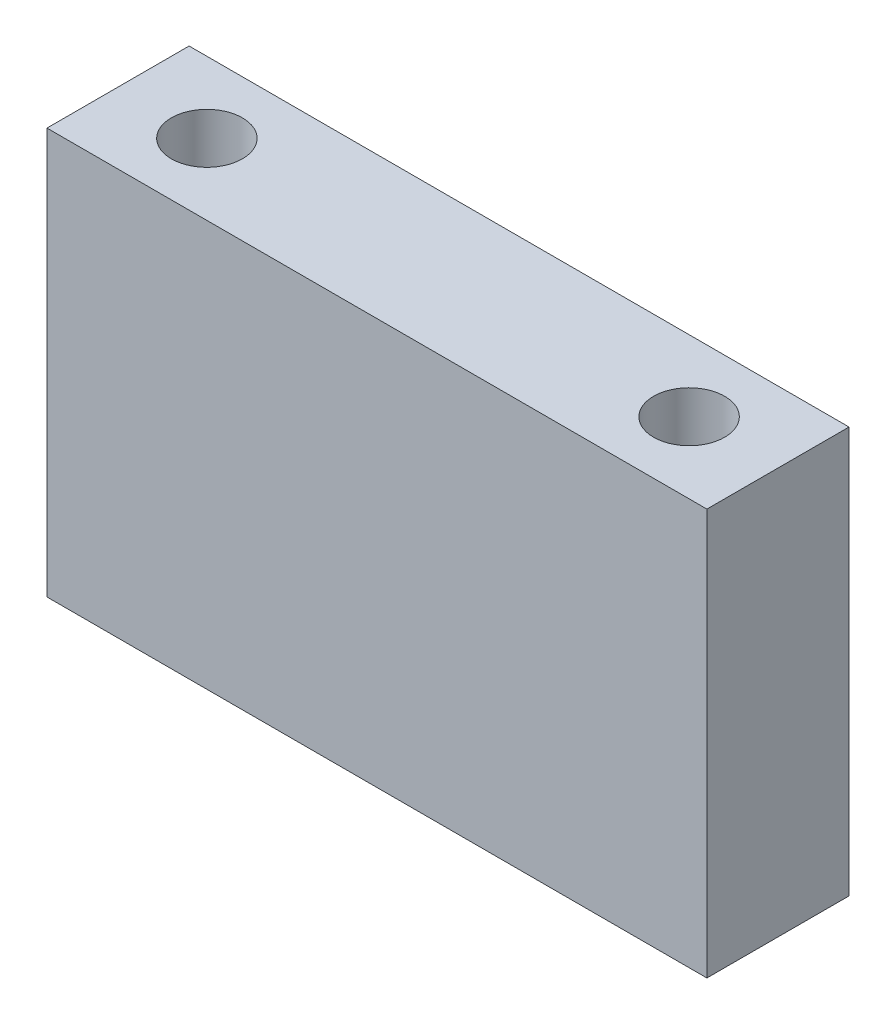
ISO-10303-21;
HEADER;
FILE_DESCRIPTION(('STEP AP214'),'2;1');
FILE_NAME('part.step','',(''),(''),'','','');
FILE_SCHEMA(('AUTOMOTIVE_DESIGN { 1 0 10303 214 1 1 1 1 }'));
ENDSEC;
DATA;
#1=APPLICATION_CONTEXT('core data for automotive mechanical design processes');
#2=APPLICATION_PROTOCOL_DEFINITION('international standard','automotive_design',2000,#1);
#3=PRODUCT_CONTEXT('',#1,'mechanical');
#4=PRODUCT('Part','Part','',(#3));
#5=PRODUCT_RELATED_PRODUCT_CATEGORY('part','',(#4));
#6=PRODUCT_DEFINITION_FORMATION('','',#4);
#7=PRODUCT_DEFINITION_CONTEXT('part definition',#1,'design');
#8=PRODUCT_DEFINITION('design','',#6,#7);
#9=PRODUCT_DEFINITION_SHAPE('','',#8);
#10=(LENGTH_UNIT() NAMED_UNIT(*) SI_UNIT(.MILLI.,.METRE.));
#11=(NAMED_UNIT(*) PLANE_ANGLE_UNIT() SI_UNIT($,.RADIAN.));
#12=(NAMED_UNIT(*) SI_UNIT($,.STERADIAN.) SOLID_ANGLE_UNIT());
#13=UNCERTAINTY_MEASURE_WITH_UNIT(LENGTH_MEASURE(1.E-05),#10,'distance_accuracy_value','');
#14=(GEOMETRIC_REPRESENTATION_CONTEXT(3) GLOBAL_UNCERTAINTY_ASSIGNED_CONTEXT((#13)) GLOBAL_UNIT_ASSIGNED_CONTEXT((#10,
#11,#12)) REPRESENTATION_CONTEXT('',''));
#15=CARTESIAN_POINT('',(0.,0.,0.));
#16=DIRECTION('',(0.,0.,1.));
#17=DIRECTION('',(1.,0.,0.));
#18=AXIS2_PLACEMENT_3D('',#15,#16,#17);
#19=CARTESIAN_POINT('',(0.,0.,14.));
#20=DIRECTION('',(1.,0.,0.));
#21=DIRECTION('',(0.,0.,-1.));
#22=AXIS2_PLACEMENT_3D('',#19,#20,#21);
#23=PLANE('',#22);
#24=DIRECTION('',(0.,-1.,0.));
#25=VECTOR('',#24,1.);
#26=CARTESIAN_POINT('',(0.,0.,0.));
#27=LINE('',#26,#25);
#28=CARTESIAN_POINT('',(0.,40.,0.));
#29=VERTEX_POINT('',#28);
#30=CARTESIAN_POINT('',(0.,0.,0.));
#31=VERTEX_POINT('',#30);
#32=EDGE_CURVE('E119',#29,#31,#27,.T.);
#33=ORIENTED_EDGE('',*,*,#32,.T.);
#34=DIRECTION('',(0.,0.,-1.));
#35=VECTOR('',#34,1.);
#36=CARTESIAN_POINT('',(0.,0.,14.));
#37=LINE('',#36,#35);
#38=CARTESIAN_POINT('',(0.,0.,14.));
#39=VERTEX_POINT('',#38);
#40=EDGE_CURVE('E13',#39,#31,#37,.T.);
#41=ORIENTED_EDGE('',*,*,#40,.F.);
#42=DIRECTION('',(0.,-1.,0.));
#43=VECTOR('',#42,1.);
#44=CARTESIAN_POINT('',(0.,0.,14.));
#45=LINE('',#44,#43);
#46=CARTESIAN_POINT('',(0.,40.,14.));
#47=VERTEX_POINT('',#46);
#48=EDGE_CURVE('E101',#47,#39,#45,.T.);
#49=ORIENTED_EDGE('',*,*,#48,.F.);
#50=DIRECTION('',(0.,0.,-1.));
#51=VECTOR('',#50,1.);
#52=CARTESIAN_POINT('',(0.,40.,14.));
#53=LINE('',#52,#51);
#54=EDGE_CURVE('E115',#47,#29,#53,.T.);
#55=ORIENTED_EDGE('',*,*,#54,.T.);
#56=EDGE_LOOP('',(#33,#41,#49,#55));
#57=FACE_BOUND('',#56,.T.);
#58=ADVANCED_FACE('F49',(#57),#23,.F.);
#59=CARTESIAN_POINT('',(0.,0.,14.));
#60=DIRECTION('',(0.,1.,0.));
#61=DIRECTION('',(0.,0.,1.));
#62=AXIS2_PLACEMENT_3D('',#59,#60,#61);
#63=PLANE('',#62);
#64=CARTESIAN_POINT('',(56.25,0.,6.99999999999999));
#65=DIRECTION('',(0.,1.,0.));
#66=DIRECTION('',(0.,0.,1.));
#67=AXIS2_PLACEMENT_3D('',#64,#65,#66);
#68=CIRCLE('',#67,3.5);
#69=CARTESIAN_POINT('',(56.25,0.,10.5));
#70=VERTEX_POINT('',#69);
#71=EDGE_CURVE('E143',#70,#70,#68,.T.);
#72=ORIENTED_EDGE('',*,*,#71,.T.);
#73=EDGE_LOOP('',(#72));
#74=FACE_BOUND('',#73,.T.);
#75=CARTESIAN_POINT('',(8.75,0.,7.));
#76=DIRECTION('',(0.,1.,0.));
#77=DIRECTION('',(0.,0.,1.));
#78=AXIS2_PLACEMENT_3D('',#75,#76,#77);
#79=CIRCLE('',#78,3.5);
#80=CARTESIAN_POINT('',(8.75,0.,10.5));
#81=VERTEX_POINT('',#80);
#82=EDGE_CURVE('E123',#81,#81,#79,.T.);
#83=ORIENTED_EDGE('',*,*,#82,.T.);
#84=EDGE_LOOP('',(#83));
#85=FACE_BOUND('',#84,.T.);
#86=DIRECTION('',(1.,0.,0.));
#87=VECTOR('',#86,1.);
#88=CARTESIAN_POINT('',(0.,0.,0.));
#89=LINE('',#88,#87);
#90=CARTESIAN_POINT('',(65.,0.,0.));
#91=VERTEX_POINT('',#90);
#92=EDGE_CURVE('E106',#31,#91,#89,.T.);
#93=ORIENTED_EDGE('',*,*,#92,.T.);
#94=DIRECTION('',(0.,0.,-1.));
#95=VECTOR('',#94,1.);
#96=CARTESIAN_POINT('',(65.,0.,14.));
#97=LINE('',#96,#95);
#98=CARTESIAN_POINT('',(65.,0.,14.));
#99=VERTEX_POINT('',#98);
#100=EDGE_CURVE('E58',#99,#91,#97,.T.);
#101=ORIENTED_EDGE('',*,*,#100,.F.);
#102=DIRECTION('',(1.,0.,0.));
#103=VECTOR('',#102,1.);
#104=CARTESIAN_POINT('',(0.,0.,14.));
#105=LINE('',#104,#103);
#106=EDGE_CURVE('E96',#39,#99,#105,.T.);
#107=ORIENTED_EDGE('',*,*,#106,.F.);
#108=ORIENTED_EDGE('',*,*,#40,.T.);
#109=EDGE_LOOP('',(#93,#101,#107,#108));
#110=FACE_BOUND('',#109,.T.);
#111=ADVANCED_FACE('F105',(#74,#85,#110),#63,.F.);
#112=CARTESIAN_POINT('',(65.,0.,14.));
#113=DIRECTION('',(-1.,0.,0.));
#114=DIRECTION('',(0.,0.,1.));
#115=AXIS2_PLACEMENT_3D('',#112,#113,#114);
#116=PLANE('',#115);
#117=DIRECTION('',(0.,1.,0.));
#118=VECTOR('',#117,1.);
#119=CARTESIAN_POINT('',(65.,0.,0.));
#120=LINE('',#119,#118);
#121=CARTESIAN_POINT('',(65.,40.,0.));
#122=VERTEX_POINT('',#121);
#123=EDGE_CURVE('E83',#91,#122,#120,.T.);
#124=ORIENTED_EDGE('',*,*,#123,.T.);
#125=DIRECTION('',(0.,0.,-1.));
#126=VECTOR('',#125,1.);
#127=CARTESIAN_POINT('',(65.,40.,14.));
#128=LINE('',#127,#126);
#129=CARTESIAN_POINT('',(65.,40.,14.));
#130=VERTEX_POINT('',#129);
#131=EDGE_CURVE('E108',#130,#122,#128,.T.);
#132=ORIENTED_EDGE('',*,*,#131,.F.);
#133=DIRECTION('',(0.,1.,0.));
#134=VECTOR('',#133,1.);
#135=CARTESIAN_POINT('',(65.,0.,14.));
#136=LINE('',#135,#134);
#137=EDGE_CURVE('E99',#99,#130,#136,.T.);
#138=ORIENTED_EDGE('',*,*,#137,.F.);
#139=ORIENTED_EDGE('',*,*,#100,.T.);
#140=EDGE_LOOP('',(#124,#132,#138,#139));
#141=FACE_BOUND('',#140,.T.);
#142=ADVANCED_FACE('F109',(#141),#116,.F.);
#143=CARTESIAN_POINT('',(0.,40.,14.));
#144=DIRECTION('',(0.,-1.,0.));
#145=DIRECTION('',(0.,0.,-1.));
#146=AXIS2_PLACEMENT_3D('',#143,#144,#145);
#147=PLANE('',#146);
#148=CARTESIAN_POINT('',(56.25,40.,6.99999999999999));
#149=DIRECTION('',(0.,1.,0.));
#150=DIRECTION('',(0.,0.,1.));
#151=AXIS2_PLACEMENT_3D('',#148,#149,#150);
#152=CIRCLE('',#151,3.5);
#153=CARTESIAN_POINT('',(56.25,40.,10.5));
#154=VERTEX_POINT('',#153);
#155=EDGE_CURVE('E147',#154,#154,#152,.T.);
#156=ORIENTED_EDGE('',*,*,#155,.F.);
#157=EDGE_LOOP('',(#156));
#158=FACE_BOUND('',#157,.T.);
#159=CARTESIAN_POINT('',(8.75,40.,7.));
#160=DIRECTION('',(0.,1.,0.));
#161=DIRECTION('',(0.,0.,1.));
#162=AXIS2_PLACEMENT_3D('',#159,#160,#161);
#163=CIRCLE('',#162,3.5);
#164=CARTESIAN_POINT('',(8.75,40.,10.5));
#165=VERTEX_POINT('',#164);
#166=EDGE_CURVE('E139',#165,#165,#163,.T.);
#167=ORIENTED_EDGE('',*,*,#166,.F.);
#168=EDGE_LOOP('',(#167));
#169=FACE_BOUND('',#168,.T.);
#170=DIRECTION('',(-1.,0.,0.));
#171=VECTOR('',#170,1.);
#172=CARTESIAN_POINT('',(0.,40.,0.));
#173=LINE('',#172,#171);
#174=EDGE_CURVE('E89',#122,#29,#173,.T.);
#175=ORIENTED_EDGE('',*,*,#174,.T.);
#176=ORIENTED_EDGE('',*,*,#54,.F.);
#177=DIRECTION('',(-1.,0.,0.));
#178=VECTOR('',#177,1.);
#179=CARTESIAN_POINT('',(0.,40.,14.));
#180=LINE('',#179,#178);
#181=EDGE_CURVE('E66',#130,#47,#180,.T.);
#182=ORIENTED_EDGE('',*,*,#181,.F.);
#183=ORIENTED_EDGE('',*,*,#131,.T.);
#184=EDGE_LOOP('',(#175,#176,#182,#183));
#185=FACE_BOUND('',#184,.T.);
#186=ADVANCED_FACE('F133',(#158,#169,#185),#147,.F.);
#187=CARTESIAN_POINT('',(0.,0.,14.));
#188=DIRECTION('',(0.,0.,-1.));
#189=DIRECTION('',(-1.,0.,0.));
#190=AXIS2_PLACEMENT_3D('',#187,#188,#189);
#191=PLANE('',#190);
#192=ORIENTED_EDGE('',*,*,#48,.T.);
#193=ORIENTED_EDGE('',*,*,#106,.T.);
#194=ORIENTED_EDGE('',*,*,#137,.T.);
#195=ORIENTED_EDGE('',*,*,#181,.T.);
#196=EDGE_LOOP('',(#192,#193,#194,#195));
#197=FACE_BOUND('',#196,.T.);
#198=ADVANCED_FACE('F97',(#197),#191,.F.);
#199=CARTESIAN_POINT('',(0.,0.,0.));
#200=DIRECTION('',(0.,0.,-1.));
#201=DIRECTION('',(-1.,0.,0.));
#202=AXIS2_PLACEMENT_3D('',#199,#200,#201);
#203=PLANE('',#202);
#204=ORIENTED_EDGE('',*,*,#32,.F.);
#205=ORIENTED_EDGE('',*,*,#174,.F.);
#206=ORIENTED_EDGE('',*,*,#123,.F.);
#207=ORIENTED_EDGE('',*,*,#92,.F.);
#208=EDGE_LOOP('',(#204,#205,#206,#207));
#209=FACE_BOUND('',#208,.T.);
#210=ADVANCED_FACE('F136',(#209),#203,.T.);
#211=CARTESIAN_POINT('',(8.75,0.,7.));
#212=DIRECTION('',(0.,1.,0.));
#213=DIRECTION('',(0.,0.,1.));
#214=AXIS2_PLACEMENT_3D('',#211,#212,#213);
#215=CYLINDRICAL_SURFACE('',#214,3.5);
#216=ORIENTED_EDGE('',*,*,#82,.F.);
#217=EDGE_LOOP('',(#216));
#218=FACE_BOUND('',#217,.T.);
#219=ORIENTED_EDGE('',*,*,#166,.T.);
#220=EDGE_LOOP('',(#219));
#221=FACE_BOUND('',#220,.T.);
#222=ADVANCED_FACE('F159',(#218,#221),#215,.F.);
#223=CARTESIAN_POINT('',(56.25,0.,6.99999999999999));
#224=DIRECTION('',(0.,1.,0.));
#225=DIRECTION('',(0.,0.,1.));
#226=AXIS2_PLACEMENT_3D('',#223,#224,#225);
#227=CYLINDRICAL_SURFACE('',#226,3.5);
#228=ORIENTED_EDGE('',*,*,#71,.F.);
#229=EDGE_LOOP('',(#228));
#230=FACE_BOUND('',#229,.T.);
#231=ORIENTED_EDGE('',*,*,#155,.T.);
#232=EDGE_LOOP('',(#231));
#233=FACE_BOUND('',#232,.T.);
#234=ADVANCED_FACE('F156',(#230,#233),#227,.F.);
#235=CLOSED_SHELL('',(#58,#111,#142,#186,#198,#210,#222,#234));
#236=MANIFOLD_SOLID_BREP('B2',#235);
#237=ADVANCED_BREP_SHAPE_REPRESENTATION('',(#18,#236),#14);
#238=SHAPE_DEFINITION_REPRESENTATION(#9,#237);
ENDSEC;
END-ISO-10303-21;
